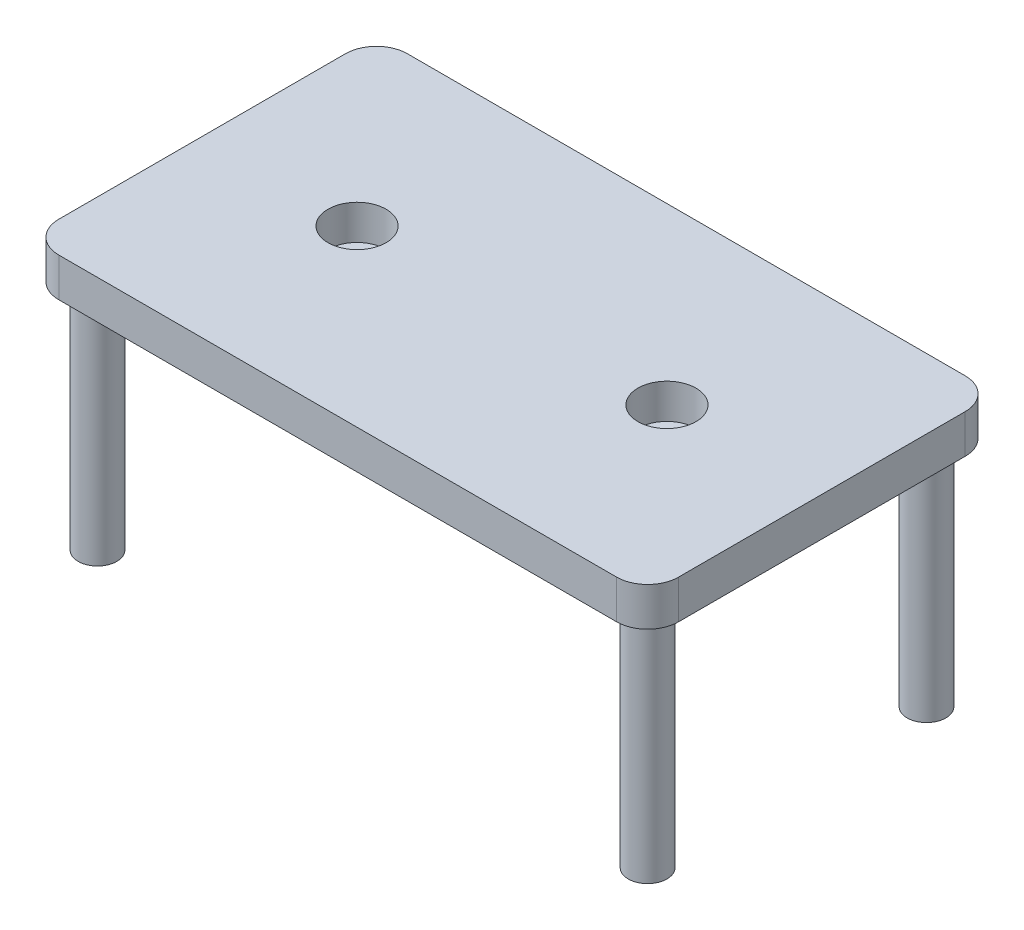
ISO-10303-21;
HEADER;
FILE_DESCRIPTION(('STEP AP214'),'2;1');
FILE_NAME('part.step','',(''),(''),'','','');
FILE_SCHEMA(('AUTOMOTIVE_DESIGN { 1 0 10303 214 1 1 1 1 }'));
ENDSEC;
DATA;
#1=APPLICATION_CONTEXT('core data for automotive mechanical design processes');
#2=APPLICATION_PROTOCOL_DEFINITION('international standard','automotive_design',2000,#1);
#3=PRODUCT_CONTEXT('',#1,'mechanical');
#4=PRODUCT('Part','Part','',(#3));
#5=PRODUCT_RELATED_PRODUCT_CATEGORY('part','',(#4));
#6=PRODUCT_DEFINITION_FORMATION('','',#4);
#7=PRODUCT_DEFINITION_CONTEXT('part definition',#1,'design');
#8=PRODUCT_DEFINITION('design','',#6,#7);
#9=PRODUCT_DEFINITION_SHAPE('','',#8);
#10=(LENGTH_UNIT() NAMED_UNIT(*) SI_UNIT(.MILLI.,.METRE.));
#11=(NAMED_UNIT(*) PLANE_ANGLE_UNIT() SI_UNIT($,.RADIAN.));
#12=(NAMED_UNIT(*) SI_UNIT($,.STERADIAN.) SOLID_ANGLE_UNIT());
#13=UNCERTAINTY_MEASURE_WITH_UNIT(LENGTH_MEASURE(1.E-05),#10,'distance_accuracy_value','');
#14=(GEOMETRIC_REPRESENTATION_CONTEXT(3) GLOBAL_UNCERTAINTY_ASSIGNED_CONTEXT((#13)) GLOBAL_UNIT_ASSIGNED_CONTEXT((#10,
#11,#12)) REPRESENTATION_CONTEXT('',''));
#15=CARTESIAN_POINT('',(0.,0.,0.));
#16=DIRECTION('',(0.,0.,1.));
#17=DIRECTION('',(1.,0.,0.));
#18=AXIS2_PLACEMENT_3D('',#15,#16,#17);
#19=CARTESIAN_POINT('',(800.,100.,-450.));
#20=DIRECTION('',(-1.,0.,0.));
#21=DIRECTION('',(0.,0.,1.));
#22=AXIS2_PLACEMENT_3D('',#19,#20,#21);
#23=PLANE('',#22);
#24=DIRECTION('',(0.,0.,-1.));
#25=VECTOR('',#24,1.);
#26=CARTESIAN_POINT('',(800.,0.,-450.));
#27=LINE('',#26,#25);
#28=CARTESIAN_POINT('',(800.,0.,370.));
#29=VERTEX_POINT('',#28);
#30=CARTESIAN_POINT('',(800.,0.,-370.));
#31=VERTEX_POINT('',#30);
#32=EDGE_CURVE('E129',#29,#31,#27,.T.);
#33=ORIENTED_EDGE('',*,*,#32,.T.);
#34=DIRECTION('',(0.,-1.,0.));
#35=VECTOR('',#34,1.);
#36=CARTESIAN_POINT('',(800.,100.,-370.));
#37=LINE('',#36,#35);
#38=CARTESIAN_POINT('',(800.,100.,-370.));
#39=VERTEX_POINT('',#38);
#40=EDGE_CURVE('E168',#31,#39,#37,.F.);
#41=ORIENTED_EDGE('',*,*,#40,.T.);
#42=DIRECTION('',(0.,0.,-1.));
#43=VECTOR('',#42,1.);
#44=CARTESIAN_POINT('',(800.,100.,-450.));
#45=LINE('',#44,#43);
#46=CARTESIAN_POINT('',(800.,100.,370.));
#47=VERTEX_POINT('',#46);
#48=EDGE_CURVE('E127',#47,#39,#45,.T.);
#49=ORIENTED_EDGE('',*,*,#48,.F.);
#50=DIRECTION('',(0.,-1.,0.));
#51=VECTOR('',#50,1.);
#52=CARTESIAN_POINT('',(800.,100.,370.));
#53=LINE('',#52,#51);
#54=EDGE_CURVE('E165',#47,#29,#53,.T.);
#55=ORIENTED_EDGE('',*,*,#54,.T.);
#56=EDGE_LOOP('',(#33,#41,#49,#55));
#57=FACE_BOUND('',#56,.T.);
#58=ADVANCED_FACE('F34',(#57),#23,.F.);
#59=CARTESIAN_POINT('',(-800.,100.,-450.));
#60=DIRECTION('',(0.,0.,1.));
#61=DIRECTION('',(1.,0.,0.));
#62=AXIS2_PLACEMENT_3D('',#59,#60,#61);
#63=PLANE('',#62);
#64=DIRECTION('',(-1.,0.,0.));
#65=VECTOR('',#64,1.);
#66=CARTESIAN_POINT('',(-800.,0.,-450.));
#67=LINE('',#66,#65);
#68=CARTESIAN_POINT('',(720.,0.,-450.));
#69=VERTEX_POINT('',#68);
#70=CARTESIAN_POINT('',(-720.,0.,-450.));
#71=VERTEX_POINT('',#70);
#72=EDGE_CURVE('E125',#69,#71,#67,.T.);
#73=ORIENTED_EDGE('',*,*,#72,.T.);
#74=DIRECTION('',(0.,-1.,0.));
#75=VECTOR('',#74,1.);
#76=CARTESIAN_POINT('',(-720.,100.,-450.));
#77=LINE('',#76,#75);
#78=CARTESIAN_POINT('',(-720.,100.,-450.));
#79=VERTEX_POINT('',#78);
#80=EDGE_CURVE('E104',#71,#79,#77,.F.);
#81=ORIENTED_EDGE('',*,*,#80,.T.);
#82=DIRECTION('',(-1.,0.,0.));
#83=VECTOR('',#82,1.);
#84=CARTESIAN_POINT('',(-800.,100.,-450.));
#85=LINE('',#84,#83);
#86=CARTESIAN_POINT('',(720.,100.,-450.));
#87=VERTEX_POINT('',#86);
#88=EDGE_CURVE('E184',#87,#79,#85,.T.);
#89=ORIENTED_EDGE('',*,*,#88,.F.);
#90=DIRECTION('',(0.,-1.,0.));
#91=VECTOR('',#90,1.);
#92=CARTESIAN_POINT('',(720.,100.,-450.));
#93=LINE('',#92,#91);
#94=EDGE_CURVE('E109',#87,#69,#93,.T.);
#95=ORIENTED_EDGE('',*,*,#94,.T.);
#96=EDGE_LOOP('',(#73,#81,#89,#95));
#97=FACE_BOUND('',#96,.T.);
#98=ADVANCED_FACE('F209',(#97),#63,.F.);
#99=CARTESIAN_POINT('',(-800.,100.,-450.));
#100=DIRECTION('',(1.,0.,0.));
#101=DIRECTION('',(0.,0.,-1.));
#102=AXIS2_PLACEMENT_3D('',#99,#100,#101);
#103=PLANE('',#102);
#104=DIRECTION('',(0.,0.,1.));
#105=VECTOR('',#104,1.);
#106=CARTESIAN_POINT('',(-800.,100.,-450.));
#107=LINE('',#106,#105);
#108=CARTESIAN_POINT('',(-800.,100.,-370.));
#109=VERTEX_POINT('',#108);
#110=CARTESIAN_POINT('',(-800.,100.,370.));
#111=VERTEX_POINT('',#110);
#112=EDGE_CURVE('E118',#109,#111,#107,.T.);
#113=ORIENTED_EDGE('',*,*,#112,.F.);
#114=DIRECTION('',(0.,-1.,0.));
#115=VECTOR('',#114,1.);
#116=CARTESIAN_POINT('',(-800.,100.,-370.));
#117=LINE('',#116,#115);
#118=CARTESIAN_POINT('',(-800.,0.,-370.));
#119=VERTEX_POINT('',#118);
#120=EDGE_CURVE('E103',#109,#119,#117,.T.);
#121=ORIENTED_EDGE('',*,*,#120,.T.);
#122=DIRECTION('',(0.,0.,1.));
#123=VECTOR('',#122,1.);
#124=CARTESIAN_POINT('',(-800.,0.,-450.));
#125=LINE('',#124,#123);
#126=CARTESIAN_POINT('',(-800.,0.,370.));
#127=VERTEX_POINT('',#126);
#128=EDGE_CURVE('E116',#119,#127,#125,.T.);
#129=ORIENTED_EDGE('',*,*,#128,.T.);
#130=DIRECTION('',(0.,-1.,0.));
#131=VECTOR('',#130,1.);
#132=CARTESIAN_POINT('',(-800.,100.,370.));
#133=LINE('',#132,#131);
#134=EDGE_CURVE('E120',#127,#111,#133,.F.);
#135=ORIENTED_EDGE('',*,*,#134,.T.);
#136=EDGE_LOOP('',(#113,#121,#129,#135));
#137=FACE_BOUND('',#136,.T.);
#138=ADVANCED_FACE('F115',(#137),#103,.F.);
#139=CARTESIAN_POINT('',(-800.,100.,450.));
#140=DIRECTION('',(0.,0.,-1.));
#141=DIRECTION('',(-1.,0.,0.));
#142=AXIS2_PLACEMENT_3D('',#139,#140,#141);
#143=PLANE('',#142);
#144=DIRECTION('',(1.,0.,0.));
#145=VECTOR('',#144,1.);
#146=CARTESIAN_POINT('',(-800.,0.,450.));
#147=LINE('',#146,#145);
#148=CARTESIAN_POINT('',(-720.,0.,450.));
#149=VERTEX_POINT('',#148);
#150=CARTESIAN_POINT('',(720.,0.,450.));
#151=VERTEX_POINT('',#150);
#152=EDGE_CURVE('E124',#149,#151,#147,.T.);
#153=ORIENTED_EDGE('',*,*,#152,.T.);
#154=DIRECTION('',(0.,-1.,0.));
#155=VECTOR('',#154,1.);
#156=CARTESIAN_POINT('',(720.,100.,450.));
#157=LINE('',#156,#155);
#158=CARTESIAN_POINT('',(720.,100.,450.));
#159=VERTEX_POINT('',#158);
#160=EDGE_CURVE('E11',#151,#159,#157,.F.);
#161=ORIENTED_EDGE('',*,*,#160,.T.);
#162=DIRECTION('',(1.,0.,0.));
#163=VECTOR('',#162,1.);
#164=CARTESIAN_POINT('',(-800.,100.,450.));
#165=LINE('',#164,#163);
#166=CARTESIAN_POINT('',(-720.,100.,450.));
#167=VERTEX_POINT('',#166);
#168=EDGE_CURVE('E149',#167,#159,#165,.T.);
#169=ORIENTED_EDGE('',*,*,#168,.F.);
#170=DIRECTION('',(0.,-1.,0.));
#171=VECTOR('',#170,1.);
#172=CARTESIAN_POINT('',(-720.,100.,450.));
#173=LINE('',#172,#171);
#174=EDGE_CURVE('E42',#167,#149,#173,.T.);
#175=ORIENTED_EDGE('',*,*,#174,.T.);
#176=EDGE_LOOP('',(#153,#161,#169,#175));
#177=FACE_BOUND('',#176,.T.);
#178=ADVANCED_FACE('F171',(#177),#143,.F.);
#179=CARTESIAN_POINT('',(0.,100.,0.));
#180=DIRECTION('',(0.,1.,0.));
#181=DIRECTION('',(0.,0.,1.));
#182=AXIS2_PLACEMENT_3D('',#179,#180,#181);
#183=PLANE('',#182);
#184=CARTESIAN_POINT('',(-400.,100.,-1.11022302462516E-13));
#185=DIRECTION('',(0.,-1.,0.));
#186=DIRECTION('',(0.,0.,1.));
#187=AXIS2_PLACEMENT_3D('',#184,#185,#186);
#188=CIRCLE('',#187,75.);
#189=CARTESIAN_POINT('',(-400.,100.,74.9999999999999));
#190=VERTEX_POINT('',#189);
#191=EDGE_CURVE('E422',#190,#190,#188,.T.);
#192=ORIENTED_EDGE('',*,*,#191,.T.);
#193=EDGE_LOOP('',(#192));
#194=FACE_BOUND('',#193,.T.);
#195=CARTESIAN_POINT('',(400.,100.,-1.11022302462516E-13));
#196=DIRECTION('',(0.,1.,0.));
#197=DIRECTION('',(0.,0.,1.));
#198=AXIS2_PLACEMENT_3D('',#195,#196,#197);
#199=CIRCLE('',#198,75.);
#200=CARTESIAN_POINT('',(400.,100.,74.9999999999999));
#201=VERTEX_POINT('',#200);
#202=EDGE_CURVE('E416',#201,#201,#199,.T.);
#203=ORIENTED_EDGE('',*,*,#202,.F.);
#204=EDGE_LOOP('',(#203));
#205=FACE_BOUND('',#204,.T.);
#206=ORIENTED_EDGE('',*,*,#88,.T.);
#207=CARTESIAN_POINT('',(-720.,100.,-370.));
#208=DIRECTION('',(0.,1.,0.));
#209=DIRECTION('',(0.,0.,1.));
#210=AXIS2_PLACEMENT_3D('',#207,#208,#209);
#211=CIRCLE('',#210,80.);
#212=EDGE_CURVE('E163',#79,#109,#211,.T.);
#213=ORIENTED_EDGE('',*,*,#212,.T.);
#214=ORIENTED_EDGE('',*,*,#112,.T.);
#215=CARTESIAN_POINT('',(-720.,100.,370.));
#216=DIRECTION('',(0.,1.,0.));
#217=DIRECTION('',(0.,0.,1.));
#218=AXIS2_PLACEMENT_3D('',#215,#216,#217);
#219=CIRCLE('',#218,80.);
#220=EDGE_CURVE('E54',#111,#167,#219,.T.);
#221=ORIENTED_EDGE('',*,*,#220,.T.);
#222=ORIENTED_EDGE('',*,*,#168,.T.);
#223=CARTESIAN_POINT('',(720.,100.,370.));
#224=DIRECTION('',(0.,1.,0.));
#225=DIRECTION('',(0.,0.,1.));
#226=AXIS2_PLACEMENT_3D('',#223,#224,#225);
#227=CIRCLE('',#226,80.);
#228=EDGE_CURVE('E159',#159,#47,#227,.T.);
#229=ORIENTED_EDGE('',*,*,#228,.T.);
#230=ORIENTED_EDGE('',*,*,#48,.T.);
#231=CARTESIAN_POINT('',(720.,100.,-370.));
#232=DIRECTION('',(0.,1.,0.));
#233=DIRECTION('',(0.,0.,1.));
#234=AXIS2_PLACEMENT_3D('',#231,#232,#233);
#235=CIRCLE('',#234,80.);
#236=EDGE_CURVE('E161',#39,#87,#235,.T.);
#237=ORIENTED_EDGE('',*,*,#236,.T.);
#238=EDGE_LOOP('',(#206,#213,#214,#221,#222,#229,#230,#237));
#239=FACE_BOUND('',#238,.T.);
#240=ADVANCED_FACE('F192',(#194,#205,#239),#183,.T.);
#241=CARTESIAN_POINT('',(0.,0.,0.));
#242=DIRECTION('',(0.,1.,0.));
#243=DIRECTION('',(0.,0.,1.));
#244=AXIS2_PLACEMENT_3D('',#241,#242,#243);
#245=PLANE('',#244);
#246=CARTESIAN_POINT('',(-710.,0.,360.));
#247=DIRECTION('',(0.,1.,0.));
#248=DIRECTION('',(0.,0.,1.));
#249=AXIS2_PLACEMENT_3D('',#246,#247,#248);
#250=CIRCLE('',#249,50.);
#251=CARTESIAN_POINT('',(-710.,0.,410.));
#252=VERTEX_POINT('',#251);
#253=EDGE_CURVE('E145',#252,#252,#250,.T.);
#254=ORIENTED_EDGE('',*,*,#253,.T.);
#255=EDGE_LOOP('',(#254));
#256=FACE_BOUND('',#255,.T.);
#257=CARTESIAN_POINT('',(710.,0.,360.));
#258=DIRECTION('',(0.,1.,0.));
#259=DIRECTION('',(0.,0.,1.));
#260=AXIS2_PLACEMENT_3D('',#257,#258,#259);
#261=CIRCLE('',#260,50.);
#262=CARTESIAN_POINT('',(710.,0.,410.));
#263=VERTEX_POINT('',#262);
#264=EDGE_CURVE('E141',#263,#263,#261,.T.);
#265=ORIENTED_EDGE('',*,*,#264,.T.);
#266=EDGE_LOOP('',(#265));
#267=FACE_BOUND('',#266,.T.);
#268=CARTESIAN_POINT('',(710.,0.,-360.));
#269=DIRECTION('',(0.,1.,0.));
#270=DIRECTION('',(0.,0.,1.));
#271=AXIS2_PLACEMENT_3D('',#268,#269,#270);
#272=CIRCLE('',#271,50.);
#273=CARTESIAN_POINT('',(710.,0.,-310.));
#274=VERTEX_POINT('',#273);
#275=EDGE_CURVE('E137',#274,#274,#272,.T.);
#276=ORIENTED_EDGE('',*,*,#275,.T.);
#277=EDGE_LOOP('',(#276));
#278=FACE_BOUND('',#277,.T.);
#279=CARTESIAN_POINT('',(-710.,0.,-360.));
#280=DIRECTION('',(0.,1.,0.));
#281=DIRECTION('',(0.,0.,1.));
#282=AXIS2_PLACEMENT_3D('',#279,#280,#281);
#283=CIRCLE('',#282,50.);
#284=CARTESIAN_POINT('',(-710.,0.,-310.));
#285=VERTEX_POINT('',#284);
#286=EDGE_CURVE('E133',#285,#285,#283,.T.);
#287=ORIENTED_EDGE('',*,*,#286,.T.);
#288=EDGE_LOOP('',(#287));
#289=FACE_BOUND('',#288,.T.);
#290=ORIENTED_EDGE('',*,*,#128,.F.);
#291=CARTESIAN_POINT('',(-720.,0.,-370.));
#292=DIRECTION('',(0.,1.,0.));
#293=DIRECTION('',(0.,0.,1.));
#294=AXIS2_PLACEMENT_3D('',#291,#292,#293);
#295=CIRCLE('',#294,80.);
#296=EDGE_CURVE('E99',#119,#71,#295,.F.);
#297=ORIENTED_EDGE('',*,*,#296,.T.);
#298=ORIENTED_EDGE('',*,*,#72,.F.);
#299=CARTESIAN_POINT('',(720.,0.,-370.));
#300=DIRECTION('',(0.,1.,0.));
#301=DIRECTION('',(0.,0.,1.));
#302=AXIS2_PLACEMENT_3D('',#299,#300,#301);
#303=CIRCLE('',#302,80.);
#304=EDGE_CURVE('E110',#69,#31,#303,.F.);
#305=ORIENTED_EDGE('',*,*,#304,.T.);
#306=ORIENTED_EDGE('',*,*,#32,.F.);
#307=CARTESIAN_POINT('',(720.,0.,370.));
#308=DIRECTION('',(0.,1.,0.));
#309=DIRECTION('',(0.,0.,1.));
#310=AXIS2_PLACEMENT_3D('',#307,#308,#309);
#311=CIRCLE('',#310,80.);
#312=EDGE_CURVE('E152',#29,#151,#311,.F.);
#313=ORIENTED_EDGE('',*,*,#312,.T.);
#314=ORIENTED_EDGE('',*,*,#152,.F.);
#315=CARTESIAN_POINT('',(-720.,0.,370.));
#316=DIRECTION('',(0.,1.,0.));
#317=DIRECTION('',(0.,0.,1.));
#318=AXIS2_PLACEMENT_3D('',#315,#316,#317);
#319=CIRCLE('',#318,80.);
#320=EDGE_CURVE('E119',#149,#127,#319,.F.);
#321=ORIENTED_EDGE('',*,*,#320,.T.);
#322=EDGE_LOOP('',(#290,#297,#298,#305,#306,#313,#314,#321));
#323=FACE_BOUND('',#322,.T.);
#324=ADVANCED_FACE('F122',(#256,#267,#278,#289,#323),#245,.F.);
#325=CARTESIAN_POINT('',(-710.,-600.,-360.));
#326=DIRECTION('',(0.,1.,0.));
#327=DIRECTION('',(0.,0.,1.));
#328=AXIS2_PLACEMENT_3D('',#325,#326,#327);
#329=CYLINDRICAL_SURFACE('',#328,50.);
#330=CARTESIAN_POINT('',(-710.,-600.,-360.));
#331=DIRECTION('',(0.,1.,0.));
#332=DIRECTION('',(0.,0.,1.));
#333=AXIS2_PLACEMENT_3D('',#330,#331,#332);
#334=CIRCLE('',#333,50.);
#335=CARTESIAN_POINT('',(-710.,-600.,-310.));
#336=VERTEX_POINT('',#335);
#337=EDGE_CURVE('E136',#336,#336,#334,.T.);
#338=ORIENTED_EDGE('',*,*,#337,.T.);
#339=EDGE_LOOP('',(#338));
#340=FACE_BOUND('',#339,.T.);
#341=ORIENTED_EDGE('',*,*,#286,.F.);
#342=EDGE_LOOP('',(#341));
#343=FACE_BOUND('',#342,.T.);
#344=ADVANCED_FACE('F201',(#340,#343),#329,.T.);
#345=CARTESIAN_POINT('',(-710.,-600.,-360.));
#346=DIRECTION('',(0.,1.,0.));
#347=DIRECTION('',(0.,0.,1.));
#348=AXIS2_PLACEMENT_3D('',#345,#346,#347);
#349=PLANE('',#348);
#350=ORIENTED_EDGE('',*,*,#337,.F.);
#351=EDGE_LOOP('',(#350));
#352=FACE_BOUND('',#351,.T.);
#353=ADVANCED_FACE('F380',(#352),#349,.F.);
#354=CARTESIAN_POINT('',(710.,-600.,-360.));
#355=DIRECTION('',(0.,1.,0.));
#356=DIRECTION('',(0.,0.,1.));
#357=AXIS2_PLACEMENT_3D('',#354,#355,#356);
#358=CYLINDRICAL_SURFACE('',#357,50.);
#359=CARTESIAN_POINT('',(710.,-600.,-360.));
#360=DIRECTION('',(0.,1.,0.));
#361=DIRECTION('',(0.,0.,-1.));
#362=AXIS2_PLACEMENT_3D('',#359,#360,#361);
#363=CIRCLE('',#362,50.);
#364=CARTESIAN_POINT('',(710.,-600.,-410.));
#365=VERTEX_POINT('',#364);
#366=EDGE_CURVE('E140',#365,#365,#363,.T.);
#367=ORIENTED_EDGE('',*,*,#366,.T.);
#368=EDGE_LOOP('',(#367));
#369=FACE_BOUND('',#368,.T.);
#370=ORIENTED_EDGE('',*,*,#275,.F.);
#371=EDGE_LOOP('',(#370));
#372=FACE_BOUND('',#371,.T.);
#373=ADVANCED_FACE('F370',(#369,#372),#358,.T.);
#374=CARTESIAN_POINT('',(710.,-600.,-360.));
#375=DIRECTION('',(0.,-1.,0.));
#376=DIRECTION('',(0.,0.,-1.));
#377=AXIS2_PLACEMENT_3D('',#374,#375,#376);
#378=PLANE('',#377);
#379=ORIENTED_EDGE('',*,*,#366,.F.);
#380=EDGE_LOOP('',(#379));
#381=FACE_BOUND('',#380,.T.);
#382=ADVANCED_FACE('F360',(#381),#378,.T.);
#383=CARTESIAN_POINT('',(710.,-600.,360.));
#384=DIRECTION('',(0.,1.,0.));
#385=DIRECTION('',(0.,0.,1.));
#386=AXIS2_PLACEMENT_3D('',#383,#384,#385);
#387=CYLINDRICAL_SURFACE('',#386,50.);
#388=CARTESIAN_POINT('',(710.,-600.,360.));
#389=DIRECTION('',(0.,1.,0.));
#390=DIRECTION('',(0.,0.,1.));
#391=AXIS2_PLACEMENT_3D('',#388,#389,#390);
#392=CIRCLE('',#391,50.);
#393=CARTESIAN_POINT('',(710.,-600.,410.));
#394=VERTEX_POINT('',#393);
#395=EDGE_CURVE('E144',#394,#394,#392,.T.);
#396=ORIENTED_EDGE('',*,*,#395,.T.);
#397=EDGE_LOOP('',(#396));
#398=FACE_BOUND('',#397,.T.);
#399=ORIENTED_EDGE('',*,*,#264,.F.);
#400=EDGE_LOOP('',(#399));
#401=FACE_BOUND('',#400,.T.);
#402=ADVANCED_FACE('F350',(#398,#401),#387,.T.);
#403=CARTESIAN_POINT('',(710.,-600.,360.));
#404=DIRECTION('',(0.,1.,0.));
#405=DIRECTION('',(0.,0.,1.));
#406=AXIS2_PLACEMENT_3D('',#403,#404,#405);
#407=PLANE('',#406);
#408=ORIENTED_EDGE('',*,*,#395,.F.);
#409=EDGE_LOOP('',(#408));
#410=FACE_BOUND('',#409,.T.);
#411=ADVANCED_FACE('F340',(#410),#407,.F.);
#412=CARTESIAN_POINT('',(-710.,-600.,360.));
#413=DIRECTION('',(0.,1.,0.));
#414=DIRECTION('',(0.,0.,1.));
#415=AXIS2_PLACEMENT_3D('',#412,#413,#414);
#416=CYLINDRICAL_SURFACE('',#415,50.);
#417=CARTESIAN_POINT('',(-710.,-600.,360.));
#418=DIRECTION('',(0.,1.,0.));
#419=DIRECTION('',(0.,0.,-1.));
#420=AXIS2_PLACEMENT_3D('',#417,#418,#419);
#421=CIRCLE('',#420,50.);
#422=CARTESIAN_POINT('',(-710.,-600.,310.));
#423=VERTEX_POINT('',#422);
#424=EDGE_CURVE('E148',#423,#423,#421,.T.);
#425=ORIENTED_EDGE('',*,*,#424,.T.);
#426=EDGE_LOOP('',(#425));
#427=FACE_BOUND('',#426,.T.);
#428=ORIENTED_EDGE('',*,*,#253,.F.);
#429=EDGE_LOOP('',(#428));
#430=FACE_BOUND('',#429,.T.);
#431=ADVANCED_FACE('F330',(#427,#430),#416,.T.);
#432=CARTESIAN_POINT('',(-710.,-600.,360.));
#433=DIRECTION('',(0.,-1.,0.));
#434=DIRECTION('',(0.,0.,-1.));
#435=AXIS2_PLACEMENT_3D('',#432,#433,#434);
#436=PLANE('',#435);
#437=ORIENTED_EDGE('',*,*,#424,.F.);
#438=EDGE_LOOP('',(#437));
#439=FACE_BOUND('',#438,.T.);
#440=ADVANCED_FACE('F320',(#439),#436,.T.);
#441=CARTESIAN_POINT('',(400.,10.,-1.11022302462516E-13));
#442=DIRECTION('',(0.,1.,0.));
#443=DIRECTION('',(0.,0.,1.));
#444=AXIS2_PLACEMENT_3D('',#441,#442,#443);
#445=CYLINDRICAL_SURFACE('',#444,75.);
#446=CARTESIAN_POINT('',(400.,10.,-1.11022302462516E-13));
#447=DIRECTION('',(0.,1.,0.));
#448=DIRECTION('',(0.,0.,1.));
#449=AXIS2_PLACEMENT_3D('',#446,#447,#448);
#450=CIRCLE('',#449,75.);
#451=CARTESIAN_POINT('',(400.,10.,74.9999999999999));
#452=VERTEX_POINT('',#451);
#453=EDGE_CURVE('E415',#452,#452,#450,.T.);
#454=ORIENTED_EDGE('',*,*,#453,.F.);
#455=EDGE_LOOP('',(#454));
#456=FACE_BOUND('',#455,.T.);
#457=ORIENTED_EDGE('',*,*,#202,.T.);
#458=EDGE_LOOP('',(#457));
#459=FACE_BOUND('',#458,.T.);
#460=ADVANCED_FACE('F310',(#456,#459),#445,.F.);
#461=CARTESIAN_POINT('',(400.,10.,-1.11022302462516E-13));
#462=DIRECTION('',(0.,1.,0.));
#463=DIRECTION('',(0.,0.,1.));
#464=AXIS2_PLACEMENT_3D('',#461,#462,#463);
#465=PLANE('',#464);
#466=ORIENTED_EDGE('',*,*,#453,.T.);
#467=EDGE_LOOP('',(#466));
#468=FACE_BOUND('',#467,.T.);
#469=ADVANCED_FACE('F300',(#468),#465,.T.);
#470=CARTESIAN_POINT('',(-400.,10.,-1.11022302462516E-13));
#471=DIRECTION('',(0.,1.,0.));
#472=DIRECTION('',(0.,0.,1.));
#473=AXIS2_PLACEMENT_3D('',#470,#471,#472);
#474=CYLINDRICAL_SURFACE('',#473,75.);
#475=CARTESIAN_POINT('',(-400.,10.,-1.11022302462516E-13));
#476=DIRECTION('',(0.,-1.,0.));
#477=DIRECTION('',(0.,0.,1.));
#478=AXIS2_PLACEMENT_3D('',#475,#476,#477);
#479=CIRCLE('',#478,75.);
#480=CARTESIAN_POINT('',(-400.,10.,74.9999999999999));
#481=VERTEX_POINT('',#480);
#482=EDGE_CURVE('E419',#481,#481,#479,.T.);
#483=ORIENTED_EDGE('',*,*,#482,.T.);
#484=EDGE_LOOP('',(#483));
#485=FACE_BOUND('',#484,.T.);
#486=ORIENTED_EDGE('',*,*,#191,.F.);
#487=EDGE_LOOP('',(#486));
#488=FACE_BOUND('',#487,.T.);
#489=ADVANCED_FACE('F290',(#485,#488),#474,.F.);
#490=CARTESIAN_POINT('',(-400.,10.,-1.11022302462516E-13));
#491=DIRECTION('',(0.,1.,0.));
#492=DIRECTION('',(0.,0.,1.));
#493=AXIS2_PLACEMENT_3D('',#490,#491,#492);
#494=PLANE('',#493);
#495=ORIENTED_EDGE('',*,*,#482,.F.);
#496=EDGE_LOOP('',(#495));
#497=FACE_BOUND('',#496,.T.);
#498=ADVANCED_FACE('F221',(#497),#494,.T.);
#499=CARTESIAN_POINT('',(-720.,100.,-370.));
#500=DIRECTION('',(0.,-1.,0.));
#501=DIRECTION('',(0.,0.,-1.));
#502=AXIS2_PLACEMENT_3D('',#499,#500,#501);
#503=CYLINDRICAL_SURFACE('',#502,80.);
#504=ORIENTED_EDGE('',*,*,#212,.F.);
#505=ORIENTED_EDGE('',*,*,#80,.F.);
#506=ORIENTED_EDGE('',*,*,#296,.F.);
#507=ORIENTED_EDGE('',*,*,#120,.F.);
#508=EDGE_LOOP('',(#504,#505,#506,#507));
#509=FACE_BOUND('',#508,.T.);
#510=ADVANCED_FACE('F102',(#509),#503,.T.);
#511=CARTESIAN_POINT('',(720.,100.,-370.));
#512=DIRECTION('',(0.,-1.,0.));
#513=DIRECTION('',(0.,0.,-1.));
#514=AXIS2_PLACEMENT_3D('',#511,#512,#513);
#515=CYLINDRICAL_SURFACE('',#514,80.);
#516=ORIENTED_EDGE('',*,*,#236,.F.);
#517=ORIENTED_EDGE('',*,*,#40,.F.);
#518=ORIENTED_EDGE('',*,*,#304,.F.);
#519=ORIENTED_EDGE('',*,*,#94,.F.);
#520=EDGE_LOOP('',(#516,#517,#518,#519));
#521=FACE_BOUND('',#520,.T.);
#522=ADVANCED_FACE('F220',(#521),#515,.T.);
#523=CARTESIAN_POINT('',(720.,100.,370.));
#524=DIRECTION('',(0.,-1.,0.));
#525=DIRECTION('',(0.,0.,-1.));
#526=AXIS2_PLACEMENT_3D('',#523,#524,#525);
#527=CYLINDRICAL_SURFACE('',#526,80.);
#528=ORIENTED_EDGE('',*,*,#228,.F.);
#529=ORIENTED_EDGE('',*,*,#160,.F.);
#530=ORIENTED_EDGE('',*,*,#312,.F.);
#531=ORIENTED_EDGE('',*,*,#54,.F.);
#532=EDGE_LOOP('',(#528,#529,#530,#531));
#533=FACE_BOUND('',#532,.T.);
#534=ADVANCED_FACE('F178',(#533),#527,.T.);
#535=CARTESIAN_POINT('',(-720.,100.,370.));
#536=DIRECTION('',(0.,-1.,0.));
#537=DIRECTION('',(0.,0.,-1.));
#538=AXIS2_PLACEMENT_3D('',#535,#536,#537);
#539=CYLINDRICAL_SURFACE('',#538,80.);
#540=ORIENTED_EDGE('',*,*,#220,.F.);
#541=ORIENTED_EDGE('',*,*,#134,.F.);
#542=ORIENTED_EDGE('',*,*,#320,.F.);
#543=ORIENTED_EDGE('',*,*,#174,.F.);
#544=EDGE_LOOP('',(#540,#541,#542,#543));
#545=FACE_BOUND('',#544,.T.);
#546=ADVANCED_FACE('F36',(#545),#539,.T.);
#547=CLOSED_SHELL('',(#58,#98,#138,#178,#240,#324,#344,#353,#373,#382,#402,#411,#431,#440,#460,
#469,#489,#498,#510,#522,#534,#546));
#548=MANIFOLD_SOLID_BREP('B2',#547);
#549=ADVANCED_BREP_SHAPE_REPRESENTATION('',(#18,#548),#14);
#550=SHAPE_DEFINITION_REPRESENTATION(#9,#549);
ENDSEC;
END-ISO-10303-21;
